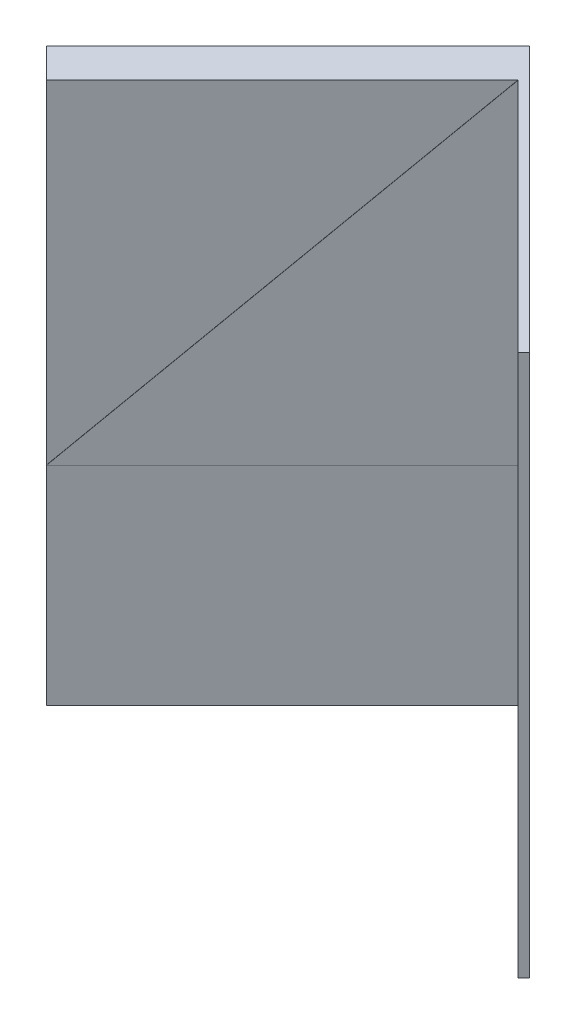
ISO-10303-21;
HEADER;
FILE_DESCRIPTION(('STEP AP214'),'2;1');
FILE_NAME('part.step','',(''),(''),'','','');
FILE_SCHEMA(('AUTOMOTIVE_DESIGN { 1 0 10303 214 1 1 1 1 }'));
ENDSEC;
DATA;
#1=APPLICATION_CONTEXT('core data for automotive mechanical design processes');
#2=APPLICATION_PROTOCOL_DEFINITION('international standard','automotive_design',2000,#1);
#3=PRODUCT_CONTEXT('',#1,'mechanical');
#4=PRODUCT('Part','Part','',(#3));
#5=PRODUCT_RELATED_PRODUCT_CATEGORY('part','',(#4));
#6=PRODUCT_DEFINITION_FORMATION('','',#4);
#7=PRODUCT_DEFINITION_CONTEXT('part definition',#1,'design');
#8=PRODUCT_DEFINITION('design','',#6,#7);
#9=PRODUCT_DEFINITION_SHAPE('','',#8);
#10=(LENGTH_UNIT() NAMED_UNIT(*) SI_UNIT(.MILLI.,.METRE.));
#11=(NAMED_UNIT(*) PLANE_ANGLE_UNIT() SI_UNIT($,.RADIAN.));
#12=(NAMED_UNIT(*) SI_UNIT($,.STERADIAN.) SOLID_ANGLE_UNIT());
#13=UNCERTAINTY_MEASURE_WITH_UNIT(LENGTH_MEASURE(1.E-05),#10,'distance_accuracy_value','');
#14=(GEOMETRIC_REPRESENTATION_CONTEXT(3) GLOBAL_UNCERTAINTY_ASSIGNED_CONTEXT((#13)) GLOBAL_UNIT_ASSIGNED_CONTEXT((#10,
#11,#12)) REPRESENTATION_CONTEXT('',''));
#15=CARTESIAN_POINT('',(0.,0.,0.));
#16=DIRECTION('',(0.,0.,1.));
#17=DIRECTION('',(1.,0.,0.));
#18=AXIS2_PLACEMENT_3D('',#15,#16,#17);
#19=CARTESIAN_POINT('',(143.684097937106,330.2,143.684097937107));
#20=DIRECTION('',(0.707106781186548,0.,-0.707106781186547));
#21=DIRECTION('',(-0.707106781186547,0.,-0.707106781186548));
#22=AXIS2_PLACEMENT_3D('',#19,#20,#21);
#23=PLANE('',#22);
#24=DIRECTION('',(-0.707106781186546,0.,-0.707106781186549));
#25=VECTOR('',#24,1.);
#26=CARTESIAN_POINT('',(0.179605122421383,127.000000000002,0.179605122421383));
#27=LINE('',#26,#25);
#28=CARTESIAN_POINT('',(0.179605122421383,127.000000000002,0.179605122421383));
#29=VERTEX_POINT('',#28);
#30=CARTESIAN_POINT('',(0.,127.000000000002,0.));
#31=VERTEX_POINT('',#30);
#32=EDGE_CURVE('E182',#29,#31,#27,.T.);
#33=ORIENTED_EDGE('',*,*,#32,.T.);
#34=DIRECTION('',(0.,-1.,0.));
#35=VECTOR('',#34,1.);
#36=CARTESIAN_POINT('',(0.,330.2,0.));
#37=LINE('',#36,#35);
#38=CARTESIAN_POINT('',(0.,0.,0.));
#39=VERTEX_POINT('',#38);
#40=EDGE_CURVE('E84',#31,#39,#37,.T.);
#41=ORIENTED_EDGE('',*,*,#40,.T.);
#42=DIRECTION('',(0.707106781186547,0.,0.707106781186548));
#43=VECTOR('',#42,1.);
#44=CARTESIAN_POINT('',(143.684097937106,0.,143.684097937107));
#45=LINE('',#44,#43);
#46=CARTESIAN_POINT('',(143.684097937106,0.,143.684097937107));
#47=VERTEX_POINT('',#46);
#48=EDGE_CURVE('E128',#39,#47,#45,.T.);
#49=ORIENTED_EDGE('',*,*,#48,.T.);
#50=DIRECTION('',(0.,-1.,0.));
#51=VECTOR('',#50,1.);
#52=CARTESIAN_POINT('',(143.684097937106,330.2,143.684097937107));
#53=LINE('',#52,#51);
#54=CARTESIAN_POINT('',(143.684097937106,330.2,143.684097937107));
#55=VERTEX_POINT('',#54);
#56=EDGE_CURVE('E11',#55,#47,#53,.T.);
#57=ORIENTED_EDGE('',*,*,#56,.F.);
#58=DIRECTION('',(0.707106781186547,0.,0.707106781186548));
#59=VECTOR('',#58,1.);
#60=CARTESIAN_POINT('',(143.684097937106,330.2,143.684097937107));
#61=LINE('',#60,#59);
#62=CARTESIAN_POINT('',(0.179605122421394,330.2,0.179605122421394));
#63=VERTEX_POINT('',#62);
#64=EDGE_CURVE('E92',#63,#55,#61,.T.);
#65=ORIENTED_EDGE('',*,*,#64,.F.);
#66=DIRECTION('',(0.,1.,0.));
#67=VECTOR('',#66,1.);
#68=CARTESIAN_POINT('',(0.179605122421383,330.2,0.179605122421383));
#69=LINE('',#68,#67);
#70=EDGE_CURVE('E180',#29,#63,#69,.T.);
#71=ORIENTED_EDGE('',*,*,#70,.F.);
#72=EDGE_LOOP('',(#33,#41,#49,#57,#65,#71));
#73=FACE_BOUND('',#72,.T.);
#74=ADVANCED_FACE('F33',(#73),#23,.F.);
#75=CARTESIAN_POINT('',(0.,330.2,0.));
#76=DIRECTION('',(-0.707106781186547,0.,-0.707106781186549));
#77=DIRECTION('',(-0.707106781186549,0.,0.707106781186547));
#78=AXIS2_PLACEMENT_3D('',#75,#76,#77);
#79=PLANE('',#78);
#80=DIRECTION('',(-0.500000000000003,-0.707106781186544,0.500000000000002));
#81=VECTOR('',#80,1.);
#82=CARTESIAN_POINT('',(-143.684097937107,127.000000000002,143.684097937106));
#83=LINE('',#82,#81);
#84=CARTESIAN_POINT('',(0.,330.2,0.));
#85=VERTEX_POINT('',#84);
#86=CARTESIAN_POINT('',(-143.684097937107,127.000000000002,143.684097937106));
#87=VERTEX_POINT('',#86);
#88=EDGE_CURVE('E161',#85,#87,#83,.T.);
#89=ORIENTED_EDGE('',*,*,#88,.F.);
#90=DIRECTION('',(0.707106781186548,0.,-0.707106781186546));
#91=VECTOR('',#90,1.);
#92=CARTESIAN_POINT('',(0.,330.2,0.));
#93=LINE('',#92,#91);
#94=CARTESIAN_POINT('',(-143.684097937107,330.2,143.684097937106));
#95=VERTEX_POINT('',#94);
#96=EDGE_CURVE('E123',#95,#85,#93,.T.);
#97=ORIENTED_EDGE('',*,*,#96,.F.);
#98=DIRECTION('',(0.,-1.,0.));
#99=VECTOR('',#98,1.);
#100=CARTESIAN_POINT('',(-143.684097937107,330.2,143.684097937106));
#101=LINE('',#100,#99);
#102=EDGE_CURVE('E143',#95,#87,#101,.T.);
#103=ORIENTED_EDGE('',*,*,#102,.T.);
#104=EDGE_LOOP('',(#89,#97,#103));
#105=FACE_BOUND('',#104,.T.);
#106=ADVANCED_FACE('F159',(#105),#79,.F.);
#107=DIRECTION('',(0.707106781186549,0.,-0.707106781186546));
#108=VECTOR('',#107,1.);
#109=CARTESIAN_POINT('',(0.,127.000000000002,0.));
#110=LINE('',#109,#108);
#111=EDGE_CURVE('E172',#87,#31,#110,.T.);
#112=ORIENTED_EDGE('',*,*,#111,.F.);
#113=CARTESIAN_POINT('',(-143.684097937107,0.,143.684097937106));
#114=VERTEX_POINT('',#113);
#115=EDGE_CURVE('E142',#87,#114,#101,.T.);
#116=ORIENTED_EDGE('',*,*,#115,.T.);
#117=DIRECTION('',(0.707106781186548,0.,-0.707106781186546));
#118=VECTOR('',#117,1.);
#119=CARTESIAN_POINT('',(0.,0.,0.));
#120=LINE('',#119,#118);
#121=EDGE_CURVE('E139',#114,#39,#120,.T.);
#122=ORIENTED_EDGE('',*,*,#121,.T.);
#123=ORIENTED_EDGE('',*,*,#40,.F.);
#124=EDGE_LOOP('',(#112,#116,#122,#123));
#125=FACE_BOUND('',#124,.T.);
#126=ADVANCED_FACE('F194',(#125),#79,.F.);
#127=CARTESIAN_POINT('',(147.276200385534,330.2,140.091995488679));
#128=DIRECTION('',(-0.707106781186548,0.,-0.707106781186548));
#129=DIRECTION('',(-0.707106781186548,0.,0.707106781186548));
#130=AXIS2_PLACEMENT_3D('',#127,#128,#129);
#131=PLANE('',#130);
#132=DIRECTION('',(0.707106781186548,0.,-0.707106781186548));
#133=VECTOR('',#132,1.);
#134=CARTESIAN_POINT('',(147.276200385534,0.,140.091995488679));
#135=LINE('',#134,#133);
#136=CARTESIAN_POINT('',(147.276200385534,0.,140.091995488679));
#137=VERTEX_POINT('',#136);
#138=EDGE_CURVE('E130',#47,#137,#135,.T.);
#139=ORIENTED_EDGE('',*,*,#138,.T.);
#140=DIRECTION('',(0.,-1.,0.));
#141=VECTOR('',#140,1.);
#142=CARTESIAN_POINT('',(147.276200385534,330.2,140.091995488679));
#143=LINE('',#142,#141);
#144=CARTESIAN_POINT('',(147.276200385534,330.2,140.091995488679));
#145=VERTEX_POINT('',#144);
#146=EDGE_CURVE('E40',#145,#137,#143,.T.);
#147=ORIENTED_EDGE('',*,*,#146,.F.);
#148=DIRECTION('',(0.707106781186548,0.,-0.707106781186548));
#149=VECTOR('',#148,1.);
#150=CARTESIAN_POINT('',(147.276200385534,330.2,140.091995488679));
#151=LINE('',#150,#149);
#152=EDGE_CURVE('E106',#55,#145,#151,.T.);
#153=ORIENTED_EDGE('',*,*,#152,.F.);
#154=ORIENTED_EDGE('',*,*,#56,.T.);
#155=EDGE_LOOP('',(#139,#147,#153,#154));
#156=FACE_BOUND('',#155,.T.);
#157=ADVANCED_FACE('F195',(#156),#131,.F.);
#158=CARTESIAN_POINT('',(-14.3684097937106,330.2,-21.552614690566));
#159=DIRECTION('',(-0.707106781186548,0.,0.707106781186547));
#160=DIRECTION('',(0.707106781186547,0.,0.707106781186548));
#161=AXIS2_PLACEMENT_3D('',#158,#159,#160);
#162=PLANE('',#161);
#163=DIRECTION('',(-0.707106781186547,0.,-0.707106781186548));
#164=VECTOR('',#163,1.);
#165=CARTESIAN_POINT('',(-14.3684097937106,0.,-21.552614690566));
#166=LINE('',#165,#164);
#167=CARTESIAN_POINT('',(-14.3684097937106,0.,-21.552614690566));
#168=VERTEX_POINT('',#167);
#169=EDGE_CURVE('E115',#137,#168,#166,.T.);
#170=ORIENTED_EDGE('',*,*,#169,.T.);
#171=DIRECTION('',(0.,-1.,0.));
#172=VECTOR('',#171,1.);
#173=CARTESIAN_POINT('',(-14.3684097937106,330.2,-21.552614690566));
#174=LINE('',#173,#172);
#175=CARTESIAN_POINT('',(-14.3684097937106,330.2,-21.552614690566));
#176=VERTEX_POINT('',#175);
#177=EDGE_CURVE('E112',#176,#168,#174,.T.);
#178=ORIENTED_EDGE('',*,*,#177,.F.);
#179=DIRECTION('',(-0.707106781186547,0.,-0.707106781186548));
#180=VECTOR('',#179,1.);
#181=CARTESIAN_POINT('',(-14.3684097937106,330.2,-21.552614690566));
#182=LINE('',#181,#180);
#183=EDGE_CURVE('E100',#145,#176,#182,.T.);
#184=ORIENTED_EDGE('',*,*,#183,.F.);
#185=ORIENTED_EDGE('',*,*,#146,.T.);
#186=EDGE_LOOP('',(#170,#178,#184,#185));
#187=FACE_BOUND('',#186,.T.);
#188=ADVANCED_FACE('F113',(#187),#162,.F.);
#189=CARTESIAN_POINT('',(-161.644610179245,330.2,125.723585694968));
#190=DIRECTION('',(0.707106781186547,0.,0.707106781186549));
#191=DIRECTION('',(0.707106781186549,0.,-0.707106781186547));
#192=AXIS2_PLACEMENT_3D('',#189,#190,#191);
#193=PLANE('',#192);
#194=DIRECTION('',(-0.707106781186548,0.,0.707106781186546));
#195=VECTOR('',#194,1.);
#196=CARTESIAN_POINT('',(-161.644610179245,0.,125.723585694968));
#197=LINE('',#196,#195);
#198=CARTESIAN_POINT('',(-161.644610179245,0.,125.723585694968));
#199=VERTEX_POINT('',#198);
#200=EDGE_CURVE('E134',#168,#199,#197,.T.);
#201=ORIENTED_EDGE('',*,*,#200,.T.);
#202=DIRECTION('',(0.,-1.,0.));
#203=VECTOR('',#202,1.);
#204=CARTESIAN_POINT('',(-161.644610179245,330.2,125.723585694968));
#205=LINE('',#204,#203);
#206=CARTESIAN_POINT('',(-161.644610179245,330.2,125.723585694968));
#207=VERTEX_POINT('',#206);
#208=EDGE_CURVE('E118',#207,#199,#205,.T.);
#209=ORIENTED_EDGE('',*,*,#208,.F.);
#210=DIRECTION('',(-0.707106781186548,0.,0.707106781186546));
#211=VECTOR('',#210,1.);
#212=CARTESIAN_POINT('',(-161.644610179245,330.2,125.723585694968));
#213=LINE('',#212,#211);
#214=EDGE_CURVE('E104',#176,#207,#213,.T.);
#215=ORIENTED_EDGE('',*,*,#214,.F.);
#216=ORIENTED_EDGE('',*,*,#177,.T.);
#217=EDGE_LOOP('',(#201,#209,#215,#216));
#218=FACE_BOUND('',#217,.T.);
#219=ADVANCED_FACE('F120',(#218),#193,.F.);
#220=CARTESIAN_POINT('',(-143.684097937107,330.2,143.684097937106));
#221=DIRECTION('',(0.707106781186548,0.,-0.707106781186547));
#222=DIRECTION('',(-0.707106781186547,0.,-0.707106781186548));
#223=AXIS2_PLACEMENT_3D('',#220,#221,#222);
#224=PLANE('',#223);
#225=DIRECTION('',(0.707106781186547,0.,0.707106781186548));
#226=VECTOR('',#225,1.);
#227=CARTESIAN_POINT('',(-143.684097937107,0.,143.684097937106));
#228=LINE('',#227,#226);
#229=EDGE_CURVE('E136',#199,#114,#228,.T.);
#230=ORIENTED_EDGE('',*,*,#229,.T.);
#231=ORIENTED_EDGE('',*,*,#115,.F.);
#232=ORIENTED_EDGE('',*,*,#102,.F.);
#233=DIRECTION('',(0.707106781186547,0.,0.707106781186548));
#234=VECTOR('',#233,1.);
#235=CARTESIAN_POINT('',(-143.684097937107,330.2,143.684097937106));
#236=LINE('',#235,#234);
#237=EDGE_CURVE('E56',#207,#95,#236,.T.);
#238=ORIENTED_EDGE('',*,*,#237,.F.);
#239=ORIENTED_EDGE('',*,*,#208,.T.);
#240=EDGE_LOOP('',(#230,#231,#232,#238,#239));
#241=FACE_BOUND('',#240,.T.);
#242=ADVANCED_FACE('F153',(#241),#224,.F.);
#243=CARTESIAN_POINT('',(0.,330.2,0.));
#244=DIRECTION('',(0.,1.,0.));
#245=DIRECTION('',(0.,0.,1.));
#246=AXIS2_PLACEMENT_3D('',#243,#244,#245);
#247=PLANE('',#246);
#248=EDGE_CURVE('E162',#85,#63,#61,.T.);
#249=ORIENTED_EDGE('',*,*,#248,.T.);
#250=ORIENTED_EDGE('',*,*,#64,.T.);
#251=ORIENTED_EDGE('',*,*,#152,.T.);
#252=ORIENTED_EDGE('',*,*,#183,.T.);
#253=ORIENTED_EDGE('',*,*,#214,.T.);
#254=ORIENTED_EDGE('',*,*,#237,.T.);
#255=ORIENTED_EDGE('',*,*,#96,.T.);
#256=EDGE_LOOP('',(#249,#250,#251,#252,#253,#254,#255));
#257=FACE_BOUND('',#256,.T.);
#258=ADVANCED_FACE('F102',(#257),#247,.T.);
#259=CARTESIAN_POINT('',(0.,0.,0.));
#260=DIRECTION('',(0.,1.,0.));
#261=DIRECTION('',(0.,0.,1.));
#262=AXIS2_PLACEMENT_3D('',#259,#260,#261);
#263=PLANE('',#262);
#264=ORIENTED_EDGE('',*,*,#48,.F.);
#265=ORIENTED_EDGE('',*,*,#121,.F.);
#266=ORIENTED_EDGE('',*,*,#229,.F.);
#267=ORIENTED_EDGE('',*,*,#200,.F.);
#268=ORIENTED_EDGE('',*,*,#169,.F.);
#269=ORIENTED_EDGE('',*,*,#138,.F.);
#270=EDGE_LOOP('',(#264,#265,#266,#267,#268,#269));
#271=FACE_BOUND('',#270,.T.);
#272=ADVANCED_FACE('F149',(#271),#263,.F.);
#273=CARTESIAN_POINT('',(-143.504492814685,127.000000000002,143.863703059528));
#274=DIRECTION('',(0.499999999999998,-0.707106781186551,-0.499999999999997));
#275=DIRECTION('',(0.816496580927729,0.577350269189622,0.));
#276=AXIS2_PLACEMENT_3D('',#273,#274,#275);
#277=PLANE('',#276);
#278=ORIENTED_EDGE('',*,*,#88,.T.);
#279=DIRECTION('',(-0.707106781186546,0.,-0.707106781186549));
#280=VECTOR('',#279,1.);
#281=CARTESIAN_POINT('',(-143.504492814685,127.000000000002,143.863703059528));
#282=LINE('',#281,#280);
#283=CARTESIAN_POINT('',(-143.504492814685,127.000000000002,143.863703059528));
#284=VERTEX_POINT('',#283);
#285=EDGE_CURVE('E131',#284,#87,#282,.T.);
#286=ORIENTED_EDGE('',*,*,#285,.F.);
#287=DIRECTION('',(-0.500000000000003,-0.707106781186544,0.500000000000002));
#288=VECTOR('',#287,1.);
#289=CARTESIAN_POINT('',(-143.504492814685,127.000000000002,143.863703059528));
#290=LINE('',#289,#288);
#291=EDGE_CURVE('E47',#63,#284,#290,.T.);
#292=ORIENTED_EDGE('',*,*,#291,.F.);
#293=ORIENTED_EDGE('',*,*,#248,.F.);
#294=EDGE_LOOP('',(#278,#286,#292,#293));
#295=FACE_BOUND('',#294,.T.);
#296=ADVANCED_FACE('F192',(#295),#277,.F.);
#297=CARTESIAN_POINT('',(0.179605122421383,127.000000000002,0.179605122421383));
#298=DIRECTION('',(0.,1.,0.));
#299=DIRECTION('',(0.,0.,1.));
#300=AXIS2_PLACEMENT_3D('',#297,#298,#299);
#301=PLANE('',#300);
#302=ORIENTED_EDGE('',*,*,#111,.T.);
#303=ORIENTED_EDGE('',*,*,#32,.F.);
#304=DIRECTION('',(0.707106781186549,0.,-0.707106781186546));
#305=VECTOR('',#304,1.);
#306=CARTESIAN_POINT('',(0.179605122421383,127.000000000002,0.179605122421383));
#307=LINE('',#306,#305);
#308=EDGE_CURVE('E177',#284,#29,#307,.T.);
#309=ORIENTED_EDGE('',*,*,#308,.F.);
#310=ORIENTED_EDGE('',*,*,#285,.T.);
#311=EDGE_LOOP('',(#302,#303,#309,#310));
#312=FACE_BOUND('',#311,.T.);
#313=ADVANCED_FACE('F183',(#312),#301,.F.);
#314=CARTESIAN_POINT('',(0.179605122421383,0.,0.179605122421383));
#315=DIRECTION('',(-0.707106781186546,0.,-0.707106781186549));
#316=DIRECTION('',(-0.707106781186549,0.,0.707106781186546));
#317=AXIS2_PLACEMENT_3D('',#314,#315,#316);
#318=PLANE('',#317);
#319=ORIENTED_EDGE('',*,*,#291,.T.);
#320=ORIENTED_EDGE('',*,*,#308,.T.);
#321=ORIENTED_EDGE('',*,*,#70,.T.);
#322=EDGE_LOOP('',(#319,#320,#321));
#323=FACE_BOUND('',#322,.T.);
#324=ADVANCED_FACE('F178',(#323),#318,.F.);
#325=CLOSED_SHELL('',(#74,#106,#126,#157,#188,#219,#242,#258,#272,#296,#313,#324));
#326=MANIFOLD_SOLID_BREP('B2',#325);
#327=ADVANCED_BREP_SHAPE_REPRESENTATION('',(#18,#326),#14);
#328=SHAPE_DEFINITION_REPRESENTATION(#9,#327);
ENDSEC;
END-ISO-10303-21;
